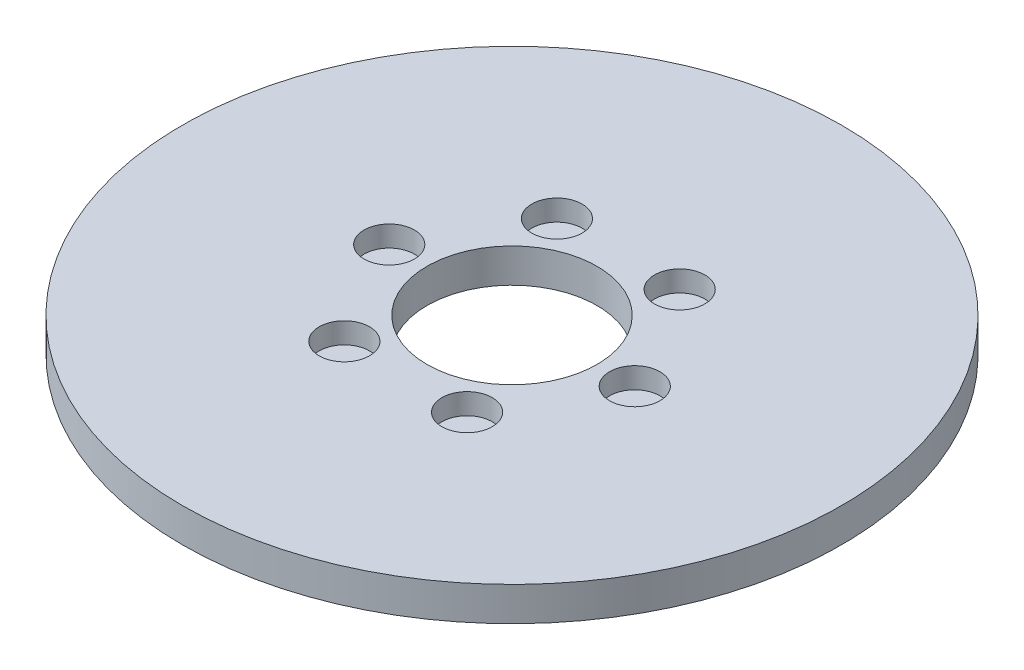
ISO-10303-21;
HEADER;
FILE_DESCRIPTION(('STEP AP214'),'2;1');
FILE_NAME('part.step','',(''),(''),'','','');
FILE_SCHEMA(('AUTOMOTIVE_DESIGN { 1 0 10303 214 1 1 1 1 }'));
ENDSEC;
DATA;
#1=APPLICATION_CONTEXT('core data for automotive mechanical design processes');
#2=APPLICATION_PROTOCOL_DEFINITION('international standard','automotive_design',2000,#1);
#3=PRODUCT_CONTEXT('',#1,'mechanical');
#4=PRODUCT('Part','Part','',(#3));
#5=PRODUCT_RELATED_PRODUCT_CATEGORY('part','',(#4));
#6=PRODUCT_DEFINITION_FORMATION('','',#4);
#7=PRODUCT_DEFINITION_CONTEXT('part definition',#1,'design');
#8=PRODUCT_DEFINITION('design','',#6,#7);
#9=PRODUCT_DEFINITION_SHAPE('','',#8);
#10=(LENGTH_UNIT() NAMED_UNIT(*) SI_UNIT(.MILLI.,.METRE.));
#11=(NAMED_UNIT(*) PLANE_ANGLE_UNIT() SI_UNIT($,.RADIAN.));
#12=(NAMED_UNIT(*) SI_UNIT($,.STERADIAN.) SOLID_ANGLE_UNIT());
#13=UNCERTAINTY_MEASURE_WITH_UNIT(LENGTH_MEASURE(1.E-05),#10,'distance_accuracy_value','');
#14=(GEOMETRIC_REPRESENTATION_CONTEXT(3) GLOBAL_UNCERTAINTY_ASSIGNED_CONTEXT((#13)) GLOBAL_UNIT_ASSIGNED_CONTEXT((#10,
#11,#12)) REPRESENTATION_CONTEXT('',''));
#15=CARTESIAN_POINT('',(0.,0.,0.));
#16=DIRECTION('',(0.,0.,1.));
#17=DIRECTION('',(1.,0.,0.));
#18=AXIS2_PLACEMENT_3D('',#15,#16,#17);
#19=CARTESIAN_POINT('',(0.,8.,0.));
#20=DIRECTION('',(0.,-1.,0.));
#21=DIRECTION('',(0.,0.,-1.));
#22=AXIS2_PLACEMENT_3D('',#19,#20,#21);
#23=CYLINDRICAL_SURFACE('',#22,77.5);
#24=CARTESIAN_POINT('',(0.,8.,0.));
#25=DIRECTION('',(0.,1.,0.));
#26=DIRECTION('',(0.,0.,1.));
#27=AXIS2_PLACEMENT_3D('',#24,#25,#26);
#28=CIRCLE('',#27,77.5);
#29=CARTESIAN_POINT('',(0.,8.,77.5));
#30=VERTEX_POINT('',#29);
#31=EDGE_CURVE('E10',#30,#30,#28,.T.);
#32=ORIENTED_EDGE('',*,*,#31,.F.);
#33=EDGE_LOOP('',(#32));
#34=FACE_BOUND('',#33,.T.);
#35=CARTESIAN_POINT('',(0.,0.,0.));
#36=DIRECTION('',(0.,1.,0.));
#37=DIRECTION('',(0.,0.,1.));
#38=AXIS2_PLACEMENT_3D('',#35,#36,#37);
#39=CIRCLE('',#38,77.5);
#40=CARTESIAN_POINT('',(0.,0.,77.5));
#41=VERTEX_POINT('',#40);
#42=EDGE_CURVE('E37',#41,#41,#39,.T.);
#43=ORIENTED_EDGE('',*,*,#42,.T.);
#44=EDGE_LOOP('',(#43));
#45=FACE_BOUND('',#44,.T.);
#46=ADVANCED_FACE('F40',(#34,#45),#23,.T.);
#47=CARTESIAN_POINT('',(0.,8.,0.));
#48=DIRECTION('',(0.,1.,0.));
#49=DIRECTION('',(0.,0.,1.));
#50=AXIS2_PLACEMENT_3D('',#47,#48,#49);
#51=PLANE('',#50);
#52=CARTESIAN_POINT('',(-14.4320457230888,8.,-24.9970364495462));
#53=DIRECTION('',(0.,1.,0.));
#54=DIRECTION('',(-0.866025403784433,0.,0.50000000000001));
#55=AXIS2_PLACEMENT_3D('',#52,#53,#54);
#56=CIRCLE('',#55,5.9223960992113);
#57=CARTESIAN_POINT('',(-19.5609911962796,8.,-22.0358383999405));
#58=VERTEX_POINT('',#57);
#59=EDGE_CURVE('E70',#58,#58,#56,.T.);
#60=ORIENTED_EDGE('',*,*,#59,.F.);
#61=EDGE_LOOP('',(#60));
#62=FACE_BOUND('',#61,.T.);
#63=CARTESIAN_POINT('',(14.4320457230883,8.,-24.9970364495465));
#64=DIRECTION('',(0.,1.,0.));
#65=DIRECTION('',(-0.866025403784443,0.,-0.499999999999992));
#66=AXIS2_PLACEMENT_3D('',#63,#64,#65);
#67=CIRCLE('',#66,5.9223960992113);
#68=CARTESIAN_POINT('',(9.3031002498974,8.,-27.9582344991521));
#69=VERTEX_POINT('',#68);
#70=EDGE_CURVE('E71',#69,#69,#67,.T.);
#71=ORIENTED_EDGE('',*,*,#70,.F.);
#72=EDGE_LOOP('',(#71));
#73=FACE_BOUND('',#72,.T.);
#74=CARTESIAN_POINT('',(28.864091446177,8.,0.));
#75=DIRECTION('',(0.,1.,0.));
#76=DIRECTION('',(0.,0.,-1.));
#77=AXIS2_PLACEMENT_3D('',#74,#75,#76);
#78=CIRCLE('',#77,5.9223960992113);
#79=CARTESIAN_POINT('',(28.864091446177,8.,-5.9223960992113));
#80=VERTEX_POINT('',#79);
#81=EDGE_CURVE('E78',#80,#80,#78,.T.);
#82=ORIENTED_EDGE('',*,*,#81,.F.);
#83=EDGE_LOOP('',(#82));
#84=FACE_BOUND('',#83,.T.);
#85=CARTESIAN_POINT('',(14.4320457230886,8.,24.9970364495464));
#86=DIRECTION('',(0.,1.,0.));
#87=DIRECTION('',(0.866025403784436,0.,-0.500000000000004));
#88=AXIS2_PLACEMENT_3D('',#85,#86,#87);
#89=CIRCLE('',#88,5.9223960992113);
#90=CARTESIAN_POINT('',(19.5609911962795,8.,22.0358383999407));
#91=VERTEX_POINT('',#90);
#92=EDGE_CURVE('E84',#91,#91,#89,.T.);
#93=ORIENTED_EDGE('',*,*,#92,.F.);
#94=EDGE_LOOP('',(#93));
#95=FACE_BOUND('',#94,.T.);
#96=CARTESIAN_POINT('',(-14.4320457230885,8.,24.9970364495464));
#97=DIRECTION('',(0.,1.,0.));
#98=DIRECTION('',(0.86602540378444,0.,0.499999999999998));
#99=AXIS2_PLACEMENT_3D('',#96,#97,#98);
#100=CIRCLE('',#99,5.9223960992113);
#101=CARTESIAN_POINT('',(-9.3031002498976,8.,27.9582344991521));
#102=VERTEX_POINT('',#101);
#103=EDGE_CURVE('E61',#102,#102,#100,.T.);
#104=ORIENTED_EDGE('',*,*,#103,.F.);
#105=EDGE_LOOP('',(#104));
#106=FACE_BOUND('',#105,.T.);
#107=CARTESIAN_POINT('',(-28.864091446177,8.,0.));
#108=DIRECTION('',(0.,1.,0.));
#109=DIRECTION('',(0.,0.,1.));
#110=AXIS2_PLACEMENT_3D('',#107,#108,#109);
#111=CIRCLE('',#110,5.9223960992113);
#112=CARTESIAN_POINT('',(-28.864091446177,8.,5.9223960992113));
#113=VERTEX_POINT('',#112);
#114=EDGE_CURVE('E54',#113,#113,#111,.T.);
#115=ORIENTED_EDGE('',*,*,#114,.F.);
#116=EDGE_LOOP('',(#115));
#117=FACE_BOUND('',#116,.T.);
#118=CARTESIAN_POINT('',(0.,8.,0.));
#119=DIRECTION('',(0.,1.,0.));
#120=DIRECTION('',(0.,0.,1.));
#121=AXIS2_PLACEMENT_3D('',#118,#119,#120);
#122=CIRCLE('',#121,20.);
#123=CARTESIAN_POINT('',(0.,8.,20.));
#124=VERTEX_POINT('',#123);
#125=EDGE_CURVE('E50',#124,#124,#122,.T.);
#126=ORIENTED_EDGE('',*,*,#125,.F.);
#127=EDGE_LOOP('',(#126));
#128=FACE_BOUND('',#127,.T.);
#129=ORIENTED_EDGE('',*,*,#31,.T.);
#130=EDGE_LOOP('',(#129));
#131=FACE_BOUND('',#130,.T.);
#132=ADVANCED_FACE('F99',(#62,#73,#84,#95,#106,#117,#128,#131),#51,.T.);
#133=CARTESIAN_POINT('',(0.,0.,0.));
#134=DIRECTION('',(0.,1.,0.));
#135=DIRECTION('',(0.,0.,1.));
#136=AXIS2_PLACEMENT_3D('',#133,#134,#135);
#137=PLANE('',#136);
#138=CARTESIAN_POINT('',(0.,0.,0.));
#139=DIRECTION('',(0.,1.,0.));
#140=DIRECTION('',(0.,0.,1.));
#141=AXIS2_PLACEMENT_3D('',#138,#139,#140);
#142=CIRCLE('',#141,20.);
#143=CARTESIAN_POINT('',(0.,0.,20.));
#144=VERTEX_POINT('',#143);
#145=EDGE_CURVE('E47',#144,#144,#142,.T.);
#146=ORIENTED_EDGE('',*,*,#145,.T.);
#147=EDGE_LOOP('',(#146));
#148=FACE_BOUND('',#147,.T.);
#149=ORIENTED_EDGE('',*,*,#42,.F.);
#150=EDGE_LOOP('',(#149));
#151=FACE_BOUND('',#150,.T.);
#152=ADVANCED_FACE('F103',(#148,#151),#137,.F.);
#153=CARTESIAN_POINT('',(0.,8.,0.));
#154=DIRECTION('',(0.,-1.,0.));
#155=DIRECTION('',(0.,0.,-1.));
#156=AXIS2_PLACEMENT_3D('',#153,#154,#155);
#157=CYLINDRICAL_SURFACE('',#156,20.);
#158=ORIENTED_EDGE('',*,*,#125,.T.);
#159=EDGE_LOOP('',(#158));
#160=FACE_BOUND('',#159,.T.);
#161=ORIENTED_EDGE('',*,*,#145,.F.);
#162=EDGE_LOOP('',(#161));
#163=FACE_BOUND('',#162,.T.);
#164=ADVANCED_FACE('F115',(#160,#163),#157,.F.);
#165=CARTESIAN_POINT('',(-28.864091446177,3.08303785190738,0.));
#166=DIRECTION('',(0.,1.,0.));
#167=DIRECTION('',(0.,0.,1.));
#168=AXIS2_PLACEMENT_3D('',#165,#166,#167);
#169=CYLINDRICAL_SURFACE('',#168,5.9223960992113);
#170=CARTESIAN_POINT('',(-28.864091446177,3.08303785190738,0.));
#171=DIRECTION('',(0.,1.,0.));
#172=DIRECTION('',(0.,0.,1.));
#173=AXIS2_PLACEMENT_3D('',#170,#171,#172);
#174=CIRCLE('',#173,5.9223960992113);
#175=CARTESIAN_POINT('',(-28.864091446177,3.08303785190738,5.9223960992113));
#176=VERTEX_POINT('',#175);
#177=EDGE_CURVE('E55',#176,#176,#174,.T.);
#178=ORIENTED_EDGE('',*,*,#177,.F.);
#179=EDGE_LOOP('',(#178));
#180=FACE_BOUND('',#179,.T.);
#181=ORIENTED_EDGE('',*,*,#114,.T.);
#182=EDGE_LOOP('',(#181));
#183=FACE_BOUND('',#182,.T.);
#184=ADVANCED_FACE('F113',(#180,#183),#169,.F.);
#185=CARTESIAN_POINT('',(-28.864091446177,3.08303785190738,0.));
#186=DIRECTION('',(0.,1.,0.));
#187=DIRECTION('',(0.,0.,1.));
#188=AXIS2_PLACEMENT_3D('',#185,#186,#187);
#189=PLANE('',#188);
#190=ORIENTED_EDGE('',*,*,#177,.T.);
#191=EDGE_LOOP('',(#190));
#192=FACE_BOUND('',#191,.T.);
#193=ADVANCED_FACE('F144',(#192),#189,.T.);
#194=CARTESIAN_POINT('',(-14.4320457230885,3.08303785190738,24.9970364495464));
#195=DIRECTION('',(0.,1.,0.));
#196=DIRECTION('',(0.,0.,1.));
#197=AXIS2_PLACEMENT_3D('',#194,#195,#196);
#198=CYLINDRICAL_SURFACE('',#197,5.9223960992113);
#199=CARTESIAN_POINT('',(-14.4320457230885,3.08303785190738,24.9970364495464));
#200=DIRECTION('',(0.,1.,0.));
#201=DIRECTION('',(0.86602540378444,0.,0.499999999999998));
#202=AXIS2_PLACEMENT_3D('',#199,#200,#201);
#203=CIRCLE('',#202,5.9223960992113);
#204=CARTESIAN_POINT('',(-9.3031002498976,3.08303785190738,27.9582344991521));
#205=VERTEX_POINT('',#204);
#206=EDGE_CURVE('E59',#205,#205,#203,.T.);
#207=ORIENTED_EDGE('',*,*,#206,.F.);
#208=EDGE_LOOP('',(#207));
#209=FACE_BOUND('',#208,.T.);
#210=ORIENTED_EDGE('',*,*,#103,.T.);
#211=EDGE_LOOP('',(#210));
#212=FACE_BOUND('',#211,.T.);
#213=ADVANCED_FACE('F153',(#209,#212),#198,.F.);
#214=CARTESIAN_POINT('',(-14.4320457230885,3.08303785190738,24.9970364495464));
#215=DIRECTION('',(0.,1.,0.));
#216=DIRECTION('',(0.86602540378444,0.,0.499999999999998));
#217=AXIS2_PLACEMENT_3D('',#214,#215,#216);
#218=PLANE('',#217);
#219=ORIENTED_EDGE('',*,*,#206,.T.);
#220=EDGE_LOOP('',(#219));
#221=FACE_BOUND('',#220,.T.);
#222=ADVANCED_FACE('F96',(#221),#218,.T.);
#223=CARTESIAN_POINT('',(14.4320457230886,3.08303785190738,24.9970364495464));
#224=DIRECTION('',(0.,1.,0.));
#225=DIRECTION('',(0.,0.,1.));
#226=AXIS2_PLACEMENT_3D('',#223,#224,#225);
#227=CYLINDRICAL_SURFACE('',#226,5.9223960992113);
#228=CARTESIAN_POINT('',(14.4320457230886,3.08303785190738,24.9970364495464));
#229=DIRECTION('',(0.,1.,0.));
#230=DIRECTION('',(0.866025403784436,0.,-0.500000000000004));
#231=AXIS2_PLACEMENT_3D('',#228,#229,#230);
#232=CIRCLE('',#231,5.9223960992113);
#233=CARTESIAN_POINT('',(19.5609911962795,3.08303785190738,22.0358383999407));
#234=VERTEX_POINT('',#233);
#235=EDGE_CURVE('E63',#234,#234,#232,.T.);
#236=ORIENTED_EDGE('',*,*,#235,.F.);
#237=EDGE_LOOP('',(#236));
#238=FACE_BOUND('',#237,.T.);
#239=ORIENTED_EDGE('',*,*,#92,.T.);
#240=EDGE_LOOP('',(#239));
#241=FACE_BOUND('',#240,.T.);
#242=ADVANCED_FACE('F91',(#238,#241),#227,.F.);
#243=CARTESIAN_POINT('',(14.4320457230886,3.08303785190738,24.9970364495464));
#244=DIRECTION('',(0.,1.,0.));
#245=DIRECTION('',(0.866025403784436,0.,-0.500000000000004));
#246=AXIS2_PLACEMENT_3D('',#243,#244,#245);
#247=PLANE('',#246);
#248=ORIENTED_EDGE('',*,*,#235,.T.);
#249=EDGE_LOOP('',(#248));
#250=FACE_BOUND('',#249,.T.);
#251=ADVANCED_FACE('F93',(#250),#247,.T.);
#252=CARTESIAN_POINT('',(28.864091446177,3.08303785190738,0.));
#253=DIRECTION('',(0.,1.,0.));
#254=DIRECTION('',(0.,0.,1.));
#255=AXIS2_PLACEMENT_3D('',#252,#253,#254);
#256=CYLINDRICAL_SURFACE('',#255,5.9223960992113);
#257=CARTESIAN_POINT('',(28.864091446177,3.08303785190738,0.));
#258=DIRECTION('',(0.,1.,0.));
#259=DIRECTION('',(0.,0.,-1.));
#260=AXIS2_PLACEMENT_3D('',#257,#258,#259);
#261=CIRCLE('',#260,5.9223960992113);
#262=CARTESIAN_POINT('',(28.864091446177,3.08303785190738,-5.9223960992113));
#263=VERTEX_POINT('',#262);
#264=EDGE_CURVE('E85',#263,#263,#261,.T.);
#265=ORIENTED_EDGE('',*,*,#264,.F.);
#266=EDGE_LOOP('',(#265));
#267=FACE_BOUND('',#266,.T.);
#268=ORIENTED_EDGE('',*,*,#81,.T.);
#269=EDGE_LOOP('',(#268));
#270=FACE_BOUND('',#269,.T.);
#271=ADVANCED_FACE('F187',(#267,#270),#256,.F.);
#272=CARTESIAN_POINT('',(28.864091446177,3.08303785190738,0.));
#273=DIRECTION('',(0.,1.,0.));
#274=DIRECTION('',(0.,0.,-1.));
#275=AXIS2_PLACEMENT_3D('',#272,#273,#274);
#276=PLANE('',#275);
#277=ORIENTED_EDGE('',*,*,#264,.T.);
#278=EDGE_LOOP('',(#277));
#279=FACE_BOUND('',#278,.T.);
#280=ADVANCED_FACE('F198',(#279),#276,.T.);
#281=CARTESIAN_POINT('',(14.4320457230883,3.08303785190738,-24.9970364495465));
#282=DIRECTION('',(0.,1.,0.));
#283=DIRECTION('',(0.,0.,1.));
#284=AXIS2_PLACEMENT_3D('',#281,#282,#283);
#285=CYLINDRICAL_SURFACE('',#284,5.9223960992113);
#286=CARTESIAN_POINT('',(14.4320457230883,3.08303785190738,-24.9970364495465));
#287=DIRECTION('',(0.,1.,0.));
#288=DIRECTION('',(-0.866025403784443,0.,-0.499999999999992));
#289=AXIS2_PLACEMENT_3D('',#286,#287,#288);
#290=CIRCLE('',#289,5.9223960992113);
#291=CARTESIAN_POINT('',(9.3031002498974,3.08303785190738,-27.9582344991521));
#292=VERTEX_POINT('',#291);
#293=EDGE_CURVE('E76',#292,#292,#290,.T.);
#294=ORIENTED_EDGE('',*,*,#293,.F.);
#295=EDGE_LOOP('',(#294));
#296=FACE_BOUND('',#295,.T.);
#297=ORIENTED_EDGE('',*,*,#70,.T.);
#298=EDGE_LOOP('',(#297));
#299=FACE_BOUND('',#298,.T.);
#300=ADVANCED_FACE('F202',(#296,#299),#285,.F.);
#301=CARTESIAN_POINT('',(14.4320457230883,3.08303785190738,-24.9970364495465));
#302=DIRECTION('',(0.,1.,0.));
#303=DIRECTION('',(-0.866025403784443,0.,-0.499999999999992));
#304=AXIS2_PLACEMENT_3D('',#301,#302,#303);
#305=PLANE('',#304);
#306=ORIENTED_EDGE('',*,*,#293,.T.);
#307=EDGE_LOOP('',(#306));
#308=FACE_BOUND('',#307,.T.);
#309=ADVANCED_FACE('F212',(#308),#305,.T.);
#310=CARTESIAN_POINT('',(-14.4320457230888,3.08303785190738,-24.9970364495462));
#311=DIRECTION('',(0.,1.,0.));
#312=DIRECTION('',(0.,0.,1.));
#313=AXIS2_PLACEMENT_3D('',#310,#311,#312);
#314=CYLINDRICAL_SURFACE('',#313,5.9223960992113);
#315=CARTESIAN_POINT('',(-14.4320457230888,3.08303785190738,-24.9970364495462));
#316=DIRECTION('',(0.,1.,0.));
#317=DIRECTION('',(-0.866025403784433,0.,0.50000000000001));
#318=AXIS2_PLACEMENT_3D('',#315,#316,#317);
#319=CIRCLE('',#318,5.9223960992113);
#320=CARTESIAN_POINT('',(-19.5609911962796,3.08303785190738,-22.0358383999405));
#321=VERTEX_POINT('',#320);
#322=EDGE_CURVE('E69',#321,#321,#319,.T.);
#323=ORIENTED_EDGE('',*,*,#322,.F.);
#324=EDGE_LOOP('',(#323));
#325=FACE_BOUND('',#324,.T.);
#326=ORIENTED_EDGE('',*,*,#59,.T.);
#327=EDGE_LOOP('',(#326));
#328=FACE_BOUND('',#327,.T.);
#329=ADVANCED_FACE('F224',(#325,#328),#314,.F.);
#330=CARTESIAN_POINT('',(-14.4320457230888,3.08303785190738,-24.9970364495462));
#331=DIRECTION('',(0.,1.,0.));
#332=DIRECTION('',(-0.866025403784433,0.,0.50000000000001));
#333=AXIS2_PLACEMENT_3D('',#330,#331,#332);
#334=PLANE('',#333);
#335=ORIENTED_EDGE('',*,*,#322,.T.);
#336=EDGE_LOOP('',(#335));
#337=FACE_BOUND('',#336,.T.);
#338=ADVANCED_FACE('F235',(#337),#334,.T.);
#339=CLOSED_SHELL('',(#46,#132,#152,#164,#184,#193,#213,#222,#242,#251,#271,#280,#300,#309,#329,#338));
#340=MANIFOLD_SOLID_BREP('B2',#339);
#341=ADVANCED_BREP_SHAPE_REPRESENTATION('',(#18,#340),#14);
#342=SHAPE_DEFINITION_REPRESENTATION(#9,#341);
ENDSEC;
END-ISO-10303-21;
